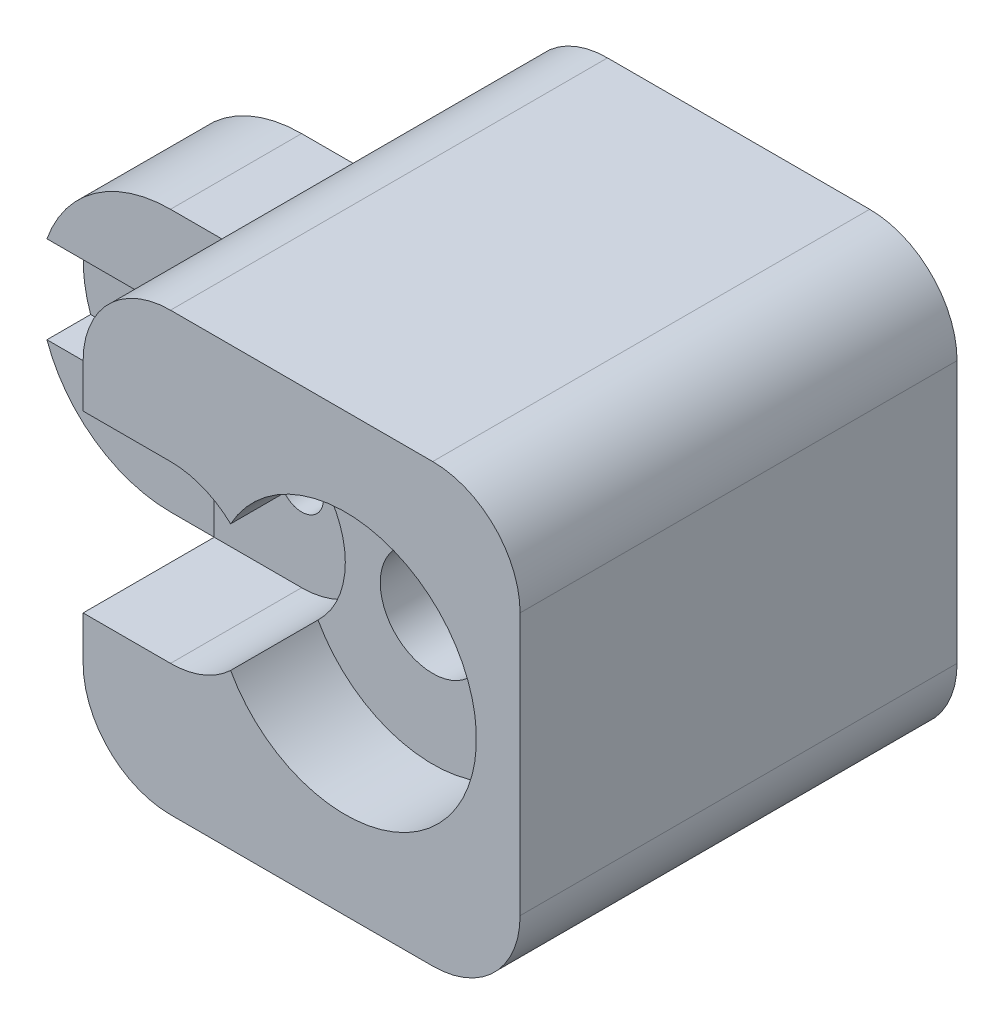
ISO-10303-21;
HEADER;
FILE_DESCRIPTION(('STEP AP214'),'2;1');
FILE_NAME('part.step','',(''),(''),'','','');
FILE_SCHEMA(('AUTOMOTIVE_DESIGN { 1 0 10303 214 1 1 1 1 }'));
ENDSEC;
DATA;
#1=APPLICATION_CONTEXT('core data for automotive mechanical design processes');
#2=APPLICATION_PROTOCOL_DEFINITION('international standard','automotive_design',2000,#1);
#3=PRODUCT_CONTEXT('',#1,'mechanical');
#4=PRODUCT('Part','Part','',(#3));
#5=PRODUCT_RELATED_PRODUCT_CATEGORY('part','',(#4));
#6=PRODUCT_DEFINITION_FORMATION('','',#4);
#7=PRODUCT_DEFINITION_CONTEXT('part definition',#1,'design');
#8=PRODUCT_DEFINITION('design','',#6,#7);
#9=PRODUCT_DEFINITION_SHAPE('','',#8);
#10=(LENGTH_UNIT() NAMED_UNIT(*) SI_UNIT(.MILLI.,.METRE.));
#11=(NAMED_UNIT(*) PLANE_ANGLE_UNIT() SI_UNIT($,.RADIAN.));
#12=(NAMED_UNIT(*) SI_UNIT($,.STERADIAN.) SOLID_ANGLE_UNIT());
#13=UNCERTAINTY_MEASURE_WITH_UNIT(LENGTH_MEASURE(1.E-05),#10,'distance_accuracy_value','');
#14=(GEOMETRIC_REPRESENTATION_CONTEXT(3) GLOBAL_UNCERTAINTY_ASSIGNED_CONTEXT((#13)) GLOBAL_UNIT_ASSIGNED_CONTEXT((#10,
#11,#12)) REPRESENTATION_CONTEXT('',''));
#15=CARTESIAN_POINT('',(0.,0.,0.));
#16=DIRECTION('',(0.,0.,1.));
#17=DIRECTION('',(1.,0.,0.));
#18=AXIS2_PLACEMENT_3D('',#15,#16,#17);
#19=CARTESIAN_POINT('',(0.,0.,100.));
#20=DIRECTION('',(1.,0.,0.));
#21=DIRECTION('',(0.,0.,-1.));
#22=AXIS2_PLACEMENT_3D('',#19,#20,#21);
#23=PLANE('',#22);
#24=DIRECTION('',(0.,0.,-1.));
#25=VECTOR('',#24,1.);
#26=CARTESIAN_POINT('',(0.,70.,20.));
#27=LINE('',#26,#25);
#28=CARTESIAN_POINT('',(0.,70.,20.));
#29=VERTEX_POINT('',#28);
#30=CARTESIAN_POINT('',(0.,70.,0.));
#31=VERTEX_POINT('',#30);
#32=EDGE_CURVE('E235',#29,#31,#27,.T.);
#33=ORIENTED_EDGE('',*,*,#32,.F.);
#34=DIRECTION('',(0.,1.,0.));
#35=VECTOR('',#34,1.);
#36=CARTESIAN_POINT('',(0.,0.,20.));
#37=LINE('',#36,#35);
#38=CARTESIAN_POINT('',(0.,30.,20.));
#39=VERTEX_POINT('',#38);
#40=EDGE_CURVE('E213',#39,#29,#37,.T.);
#41=ORIENTED_EDGE('',*,*,#40,.F.);
#42=DIRECTION('',(0.,0.,-1.));
#43=VECTOR('',#42,1.);
#44=CARTESIAN_POINT('',(0.,30.,20.));
#45=LINE('',#44,#43);
#46=CARTESIAN_POINT('',(0.,30.,0.));
#47=VERTEX_POINT('',#46);
#48=EDGE_CURVE('E238',#39,#47,#45,.T.);
#49=ORIENTED_EDGE('',*,*,#48,.T.);
#50=DIRECTION('',(0.,-1.,0.));
#51=VECTOR('',#50,1.);
#52=CARTESIAN_POINT('',(0.,0.,0.));
#53=LINE('',#52,#51);
#54=CARTESIAN_POINT('',(0.,20.,0.));
#55=VERTEX_POINT('',#54);
#56=EDGE_CURVE('E389',#47,#55,#53,.T.);
#57=ORIENTED_EDGE('',*,*,#56,.T.);
#58=DIRECTION('',(0.,0.,1.));
#59=VECTOR('',#58,1.);
#60=CARTESIAN_POINT('',(0.,20.,0.));
#61=LINE('',#60,#59);
#62=CARTESIAN_POINT('',(0.,20.,30.));
#63=VERTEX_POINT('',#62);
#64=EDGE_CURVE('E355',#55,#63,#61,.T.);
#65=ORIENTED_EDGE('',*,*,#64,.T.);
#66=DIRECTION('',(0.,1.,0.));
#67=VECTOR('',#66,1.);
#68=CARTESIAN_POINT('',(0.,80.,30.));
#69=LINE('',#68,#67);
#70=CARTESIAN_POINT('',(0.,80.,30.));
#71=VERTEX_POINT('',#70);
#72=EDGE_CURVE('E308',#63,#71,#69,.T.);
#73=ORIENTED_EDGE('',*,*,#72,.T.);
#74=DIRECTION('',(0.,0.,1.));
#75=VECTOR('',#74,1.);
#76=CARTESIAN_POINT('',(0.,80.,0.));
#77=LINE('',#76,#75);
#78=CARTESIAN_POINT('',(0.,80.,0.));
#79=VERTEX_POINT('',#78);
#80=EDGE_CURVE('E386',#79,#71,#77,.T.);
#81=ORIENTED_EDGE('',*,*,#80,.F.);
#82=EDGE_CURVE('E404',#79,#31,#53,.T.);
#83=ORIENTED_EDGE('',*,*,#82,.T.);
#84=EDGE_LOOP('',(#33,#41,#49,#57,#65,#73,#81,#83));
#85=FACE_BOUND('',#84,.T.);
#86=ADVANCED_FACE('F35',(#85),#23,.F.);
#87=CARTESIAN_POINT('',(0.,0.,0.));
#88=DIRECTION('',(0.,0.,-1.));
#89=DIRECTION('',(-1.,0.,0.));
#90=AXIS2_PLACEMENT_3D('',#87,#88,#89);
#91=PLANE('',#90);
#92=CARTESIAN_POINT('',(60.,50.,0.));
#93=DIRECTION('',(0.,0.,-1.));
#94=DIRECTION('',(-1.,0.,0.));
#95=AXIS2_PLACEMENT_3D('',#92,#93,#94);
#96=CIRCLE('',#95,12.);
#97=CARTESIAN_POINT('',(48.,50.,0.));
#98=VERTEX_POINT('',#97);
#99=EDGE_CURVE('E342',#98,#98,#96,.T.);
#100=ORIENTED_EDGE('',*,*,#99,.F.);
#101=EDGE_LOOP('',(#100));
#102=FACE_BOUND('',#101,.T.);
#103=CARTESIAN_POINT('',(20.,50.,0.));
#104=DIRECTION('',(0.,0.,-1.));
#105=DIRECTION('',(-1.,0.,0.));
#106=AXIS2_PLACEMENT_3D('',#103,#104,#105);
#107=CIRCLE('',#106,20.);
#108=CARTESIAN_POINT('',(20.,70.,0.));
#109=VERTEX_POINT('',#108);
#110=CARTESIAN_POINT('',(20.,30.,0.));
#111=VERTEX_POINT('',#110);
#112=EDGE_CURVE('E232',#109,#111,#107,.T.);
#113=ORIENTED_EDGE('',*,*,#112,.F.);
#114=DIRECTION('',(-1.,0.,0.));
#115=VECTOR('',#114,1.);
#116=CARTESIAN_POINT('',(0.,70.,0.));
#117=LINE('',#116,#115);
#118=EDGE_CURVE('E50',#109,#31,#117,.T.);
#119=ORIENTED_EDGE('',*,*,#118,.T.);
#120=ORIENTED_EDGE('',*,*,#82,.F.);
#121=CARTESIAN_POINT('',(20.,80.,0.));
#122=DIRECTION('',(0.,0.,-1.));
#123=DIRECTION('',(1.,0.,0.));
#124=AXIS2_PLACEMENT_3D('',#121,#122,#123);
#125=CIRCLE('',#124,20.);
#126=CARTESIAN_POINT('',(20.,100.,0.));
#127=VERTEX_POINT('',#126);
#128=EDGE_CURVE('E380',#79,#127,#125,.T.);
#129=ORIENTED_EDGE('',*,*,#128,.T.);
#130=DIRECTION('',(-1.,0.,0.));
#131=VECTOR('',#130,1.);
#132=CARTESIAN_POINT('',(0.,100.,0.));
#133=LINE('',#132,#131);
#134=CARTESIAN_POINT('',(80.,100.,0.));
#135=VERTEX_POINT('',#134);
#136=EDGE_CURVE('E411',#135,#127,#133,.T.);
#137=ORIENTED_EDGE('',*,*,#136,.F.);
#138=CARTESIAN_POINT('',(80.,80.,0.));
#139=DIRECTION('',(0.,0.,-1.));
#140=DIRECTION('',(-1.,0.,0.));
#141=AXIS2_PLACEMENT_3D('',#138,#139,#140);
#142=CIRCLE('',#141,20.);
#143=CARTESIAN_POINT('',(100.,80.,0.));
#144=VERTEX_POINT('',#143);
#145=EDGE_CURVE('E369',#135,#144,#142,.T.);
#146=ORIENTED_EDGE('',*,*,#145,.T.);
#147=DIRECTION('',(0.,1.,0.));
#148=VECTOR('',#147,1.);
#149=CARTESIAN_POINT('',(100.,0.,0.));
#150=LINE('',#149,#148);
#151=CARTESIAN_POINT('',(100.,20.,0.));
#152=VERTEX_POINT('',#151);
#153=EDGE_CURVE('E409',#152,#144,#150,.T.);
#154=ORIENTED_EDGE('',*,*,#153,.F.);
#155=CARTESIAN_POINT('',(80.,20.,0.));
#156=DIRECTION('',(0.,0.,-1.));
#157=DIRECTION('',(1.,0.,0.));
#158=AXIS2_PLACEMENT_3D('',#155,#156,#157);
#159=CIRCLE('',#158,20.);
#160=CARTESIAN_POINT('',(80.,0.,0.));
#161=VERTEX_POINT('',#160);
#162=EDGE_CURVE('E358',#152,#161,#159,.T.);
#163=ORIENTED_EDGE('',*,*,#162,.T.);
#164=DIRECTION('',(1.,0.,0.));
#165=VECTOR('',#164,1.);
#166=CARTESIAN_POINT('',(0.,0.,0.));
#167=LINE('',#166,#165);
#168=CARTESIAN_POINT('',(20.,0.,0.));
#169=VERTEX_POINT('',#168);
#170=EDGE_CURVE('E407',#169,#161,#167,.T.);
#171=ORIENTED_EDGE('',*,*,#170,.F.);
#172=CARTESIAN_POINT('',(20.,20.,0.));
#173=DIRECTION('',(0.,0.,-1.));
#174=DIRECTION('',(1.,0.,0.));
#175=AXIS2_PLACEMENT_3D('',#172,#173,#174);
#176=CIRCLE('',#175,20.);
#177=EDGE_CURVE('E346',#169,#55,#176,.T.);
#178=ORIENTED_EDGE('',*,*,#177,.T.);
#179=ORIENTED_EDGE('',*,*,#56,.F.);
#180=DIRECTION('',(-1.,0.,0.));
#181=VECTOR('',#180,1.);
#182=CARTESIAN_POINT('',(0.,30.,0.));
#183=LINE('',#182,#181);
#184=EDGE_CURVE('E222',#111,#47,#183,.T.);
#185=ORIENTED_EDGE('',*,*,#184,.F.);
#186=EDGE_LOOP('',(#113,#119,#120,#129,#137,#146,#154,#163,#171,#178,#179,#185));
#187=FACE_BOUND('',#186,.T.);
#188=ADVANCED_FACE('F452',(#102,#187),#91,.T.);
#189=CARTESIAN_POINT('',(20.,50.,70.));
#190=DIRECTION('',(0.,0.,-1.));
#191=DIRECTION('',(-1.,0.,0.));
#192=AXIS2_PLACEMENT_3D('',#189,#190,#191);
#193=CYLINDRICAL_SURFACE('',#192,5.);
#194=CARTESIAN_POINT('',(20.,50.,20.));
#195=DIRECTION('',(0.,0.,-1.));
#196=DIRECTION('',(-1.,0.,0.));
#197=AXIS2_PLACEMENT_3D('',#194,#195,#196);
#198=CIRCLE('',#197,5.);
#199=CARTESIAN_POINT('',(15.,50.,20.));
#200=VERTEX_POINT('',#199);
#201=EDGE_CURVE('E237',#200,#200,#198,.T.);
#202=ORIENTED_EDGE('',*,*,#201,.T.);
#203=EDGE_LOOP('',(#202));
#204=FACE_BOUND('',#203,.T.);
#205=CARTESIAN_POINT('',(20.,50.,70.));
#206=DIRECTION('',(0.,0.,-1.));
#207=DIRECTION('',(-1.,0.,0.));
#208=AXIS2_PLACEMENT_3D('',#205,#206,#207);
#209=CIRCLE('',#208,5.);
#210=CARTESIAN_POINT('',(15.,50.,70.));
#211=VERTEX_POINT('',#210);
#212=EDGE_CURVE('E270',#211,#211,#209,.T.);
#213=ORIENTED_EDGE('',*,*,#212,.F.);
#214=EDGE_LOOP('',(#213));
#215=FACE_BOUND('',#214,.T.);
#216=ADVANCED_FACE('F512',(#204,#215),#193,.F.);
#217=CARTESIAN_POINT('',(20.,50.,80.));
#218=DIRECTION('',(0.,0.,-1.));
#219=DIRECTION('',(-1.,0.,0.));
#220=AXIS2_PLACEMENT_3D('',#217,#218,#219);
#221=PLANE('',#220);
#222=CARTESIAN_POINT('',(60.,50.,80.));
#223=DIRECTION('',(0.,0.,1.));
#224=DIRECTION('',(1.,0.,0.));
#225=AXIS2_PLACEMENT_3D('',#222,#223,#224);
#226=CIRCLE('',#225,12.);
#227=CARTESIAN_POINT('',(72.,50.,80.));
#228=VERTEX_POINT('',#227);
#229=EDGE_CURVE('E248',#228,#228,#226,.F.);
#230=ORIENTED_EDGE('',*,*,#229,.T.);
#231=EDGE_LOOP('',(#230));
#232=FACE_BOUND('',#231,.T.);
#233=CARTESIAN_POINT('',(20.,50.,80.));
#234=DIRECTION('',(0.,0.,-1.));
#235=DIRECTION('',(-1.,0.,0.));
#236=AXIS2_PLACEMENT_3D('',#233,#234,#235);
#237=CIRCLE('',#236,20.);
#238=CARTESIAN_POINT('',(33.75,35.4763124517222,80.));
#239=VERTEX_POINT('',#238);
#240=CARTESIAN_POINT('',(33.75,64.5236875482778,80.));
#241=VERTEX_POINT('',#240);
#242=EDGE_CURVE('E11',#239,#241,#237,.F.);
#243=ORIENTED_EDGE('',*,*,#242,.F.);
#244=CARTESIAN_POINT('',(60.,50.,80.));
#245=DIRECTION('',(0.,0.,1.));
#246=DIRECTION('',(1.,0.,0.));
#247=AXIS2_PLACEMENT_3D('',#244,#245,#246);
#248=CIRCLE('',#247,30.);
#249=EDGE_CURVE('E246',#239,#241,#248,.T.);
#250=ORIENTED_EDGE('',*,*,#249,.T.);
#251=EDGE_LOOP('',(#243,#250));
#252=FACE_BOUND('',#251,.T.);
#253=ADVANCED_FACE('F550',(#232,#252),#221,.F.);
#254=CARTESIAN_POINT('',(20.,50.,70.));
#255=DIRECTION('',(0.,0.,1.));
#256=DIRECTION('',(1.,0.,0.));
#257=AXIS2_PLACEMENT_3D('',#254,#255,#256);
#258=CYLINDRICAL_SURFACE('',#257,20.);
#259=DIRECTION('',(0.,0.,1.));
#260=VECTOR('',#259,1.);
#261=CARTESIAN_POINT('',(33.75,35.4763124517222,85.));
#262=LINE('',#261,#260);
#263=CARTESIAN_POINT('',(33.75,35.4763124517222,100.));
#264=VERTEX_POINT('',#263);
#265=EDGE_CURVE('E403',#264,#239,#262,.F.);
#266=ORIENTED_EDGE('',*,*,#265,.T.);
#267=ORIENTED_EDGE('',*,*,#242,.T.);
#268=DIRECTION('',(0.,0.,1.));
#269=VECTOR('',#268,1.);
#270=CARTESIAN_POINT('',(33.75,64.5236875482778,85.));
#271=LINE('',#270,#269);
#272=CARTESIAN_POINT('',(33.75,64.5236875482778,100.));
#273=VERTEX_POINT('',#272);
#274=EDGE_CURVE('E43',#241,#273,#271,.T.);
#275=ORIENTED_EDGE('',*,*,#274,.T.);
#276=CARTESIAN_POINT('',(20.,50.,100.));
#277=DIRECTION('',(0.,0.,1.));
#278=DIRECTION('',(-1.,0.,0.));
#279=AXIS2_PLACEMENT_3D('',#276,#277,#278);
#280=CIRCLE('',#279,20.);
#281=CARTESIAN_POINT('',(20.,70.,100.));
#282=VERTEX_POINT('',#281);
#283=EDGE_CURVE('E251',#273,#282,#280,.T.);
#284=ORIENTED_EDGE('',*,*,#283,.T.);
#285=DIRECTION('',(0.,0.,1.));
#286=VECTOR('',#285,1.);
#287=CARTESIAN_POINT('',(20.,70.,70.));
#288=LINE('',#287,#286);
#289=CARTESIAN_POINT('',(20.,70.,70.));
#290=VERTEX_POINT('',#289);
#291=EDGE_CURVE('E261',#290,#282,#288,.T.);
#292=ORIENTED_EDGE('',*,*,#291,.F.);
#293=CARTESIAN_POINT('',(20.,50.,70.));
#294=DIRECTION('',(0.,0.,1.));
#295=DIRECTION('',(1.,0.,0.));
#296=AXIS2_PLACEMENT_3D('',#293,#294,#295);
#297=CIRCLE('',#296,20.);
#298=CARTESIAN_POINT('',(20.,30.,70.));
#299=VERTEX_POINT('',#298);
#300=EDGE_CURVE('E244',#290,#299,#297,.F.);
#301=ORIENTED_EDGE('',*,*,#300,.T.);
#302=DIRECTION('',(0.,0.,1.));
#303=VECTOR('',#302,1.);
#304=CARTESIAN_POINT('',(20.,30.,70.));
#305=LINE('',#304,#303);
#306=CARTESIAN_POINT('',(20.,30.,100.));
#307=VERTEX_POINT('',#306);
#308=EDGE_CURVE('E268',#299,#307,#305,.T.);
#309=ORIENTED_EDGE('',*,*,#308,.T.);
#310=EDGE_CURVE('E262',#307,#264,#280,.T.);
#311=ORIENTED_EDGE('',*,*,#310,.T.);
#312=EDGE_LOOP('',(#266,#267,#275,#284,#292,#301,#309,#311));
#313=FACE_BOUND('',#312,.T.);
#314=ADVANCED_FACE('F418',(#313),#258,.F.);
#315=CARTESIAN_POINT('',(20.,50.,70.));
#316=DIRECTION('',(0.,0.,-1.));
#317=DIRECTION('',(-1.,0.,0.));
#318=AXIS2_PLACEMENT_3D('',#315,#316,#317);
#319=PLANE('',#318);
#320=ORIENTED_EDGE('',*,*,#212,.T.);
#321=EDGE_LOOP('',(#320));
#322=FACE_BOUND('',#321,.T.);
#323=ORIENTED_EDGE('',*,*,#300,.F.);
#324=DIRECTION('',(-1.,0.,0.));
#325=VECTOR('',#324,1.);
#326=CARTESIAN_POINT('',(20.,70.,70.));
#327=LINE('',#326,#325);
#328=CARTESIAN_POINT('',(0.,70.,70.));
#329=VERTEX_POINT('',#328);
#330=EDGE_CURVE('E252',#290,#329,#327,.T.);
#331=ORIENTED_EDGE('',*,*,#330,.T.);
#332=DIRECTION('',(0.,-1.,0.));
#333=VECTOR('',#332,1.);
#334=CARTESIAN_POINT('',(0.,70.,70.));
#335=LINE('',#334,#333);
#336=CARTESIAN_POINT('',(0.,30.,70.));
#337=VERTEX_POINT('',#336);
#338=EDGE_CURVE('E255',#329,#337,#335,.T.);
#339=ORIENTED_EDGE('',*,*,#338,.T.);
#340=DIRECTION('',(1.,0.,0.));
#341=VECTOR('',#340,1.);
#342=CARTESIAN_POINT('',(0.,30.,70.));
#343=LINE('',#342,#341);
#344=EDGE_CURVE('E258',#337,#299,#343,.T.);
#345=ORIENTED_EDGE('',*,*,#344,.T.);
#346=EDGE_LOOP('',(#323,#331,#339,#345));
#347=FACE_BOUND('',#346,.T.);
#348=ADVANCED_FACE('F562',(#322,#347),#319,.F.);
#349=CARTESIAN_POINT('',(0.,0.,100.));
#350=DIRECTION('',(0.,0.,-1.));
#351=DIRECTION('',(-1.,0.,0.));
#352=AXIS2_PLACEMENT_3D('',#349,#350,#351);
#353=PLANE('',#352);
#354=CARTESIAN_POINT('',(60.,50.,100.));
#355=DIRECTION('',(0.,0.,-1.));
#356=DIRECTION('',(-1.,0.,0.));
#357=AXIS2_PLACEMENT_3D('',#354,#355,#356);
#358=CIRCLE('',#357,30.);
#359=EDGE_CURVE('E279',#264,#273,#358,.F.);
#360=ORIENTED_EDGE('',*,*,#359,.F.);
#361=ORIENTED_EDGE('',*,*,#310,.F.);
#362=DIRECTION('',(1.,0.,0.));
#363=VECTOR('',#362,1.);
#364=CARTESIAN_POINT('',(0.,30.,100.));
#365=LINE('',#364,#363);
#366=CARTESIAN_POINT('',(0.,30.,100.));
#367=VERTEX_POINT('',#366);
#368=EDGE_CURVE('E256',#367,#307,#365,.T.);
#369=ORIENTED_EDGE('',*,*,#368,.F.);
#370=DIRECTION('',(0.,-1.,0.));
#371=VECTOR('',#370,1.);
#372=CARTESIAN_POINT('',(0.,0.,100.));
#373=LINE('',#372,#371);
#374=CARTESIAN_POINT('',(0.,20.,100.));
#375=VERTEX_POINT('',#374);
#376=EDGE_CURVE('E397',#367,#375,#373,.T.);
#377=ORIENTED_EDGE('',*,*,#376,.T.);
#378=CARTESIAN_POINT('',(20.,20.,100.));
#379=DIRECTION('',(0.,0.,-1.));
#380=DIRECTION('',(1.,0.,0.));
#381=AXIS2_PLACEMENT_3D('',#378,#379,#380);
#382=CIRCLE('',#381,20.);
#383=CARTESIAN_POINT('',(20.,0.,100.));
#384=VERTEX_POINT('',#383);
#385=EDGE_CURVE('E345',#384,#375,#382,.T.);
#386=ORIENTED_EDGE('',*,*,#385,.F.);
#387=DIRECTION('',(1.,0.,0.));
#388=VECTOR('',#387,1.);
#389=CARTESIAN_POINT('',(0.,0.,100.));
#390=LINE('',#389,#388);
#391=CARTESIAN_POINT('',(80.,0.,100.));
#392=VERTEX_POINT('',#391);
#393=EDGE_CURVE('E396',#384,#392,#390,.T.);
#394=ORIENTED_EDGE('',*,*,#393,.T.);
#395=CARTESIAN_POINT('',(80.,20.,100.));
#396=DIRECTION('',(0.,0.,-1.));
#397=DIRECTION('',(1.,0.,0.));
#398=AXIS2_PLACEMENT_3D('',#395,#396,#397);
#399=CIRCLE('',#398,20.);
#400=CARTESIAN_POINT('',(100.,20.,100.));
#401=VERTEX_POINT('',#400);
#402=EDGE_CURVE('E354',#401,#392,#399,.T.);
#403=ORIENTED_EDGE('',*,*,#402,.F.);
#404=DIRECTION('',(0.,1.,0.));
#405=VECTOR('',#404,1.);
#406=CARTESIAN_POINT('',(100.,0.,100.));
#407=LINE('',#406,#405);
#408=CARTESIAN_POINT('',(100.,80.,100.));
#409=VERTEX_POINT('',#408);
#410=EDGE_CURVE('E399',#401,#409,#407,.T.);
#411=ORIENTED_EDGE('',*,*,#410,.T.);
#412=CARTESIAN_POINT('',(80.,80.,100.));
#413=DIRECTION('',(0.,0.,-1.));
#414=DIRECTION('',(-1.,0.,0.));
#415=AXIS2_PLACEMENT_3D('',#412,#413,#414);
#416=CIRCLE('',#415,20.);
#417=CARTESIAN_POINT('',(80.,100.,100.));
#418=VERTEX_POINT('',#417);
#419=EDGE_CURVE('E366',#418,#409,#416,.T.);
#420=ORIENTED_EDGE('',*,*,#419,.F.);
#421=DIRECTION('',(-1.,0.,0.));
#422=VECTOR('',#421,1.);
#423=CARTESIAN_POINT('',(0.,100.,100.));
#424=LINE('',#423,#422);
#425=CARTESIAN_POINT('',(20.,100.,100.));
#426=VERTEX_POINT('',#425);
#427=EDGE_CURVE('E401',#418,#426,#424,.T.);
#428=ORIENTED_EDGE('',*,*,#427,.T.);
#429=CARTESIAN_POINT('',(20.,80.,100.));
#430=DIRECTION('',(0.,0.,-1.));
#431=DIRECTION('',(1.,0.,0.));
#432=AXIS2_PLACEMENT_3D('',#429,#430,#431);
#433=CIRCLE('',#432,20.);
#434=CARTESIAN_POINT('',(0.,80.,100.));
#435=VERTEX_POINT('',#434);
#436=EDGE_CURVE('E377',#435,#426,#433,.T.);
#437=ORIENTED_EDGE('',*,*,#436,.F.);
#438=CARTESIAN_POINT('',(0.,70.,100.));
#439=VERTEX_POINT('',#438);
#440=EDGE_CURVE('E393',#435,#439,#373,.T.);
#441=ORIENTED_EDGE('',*,*,#440,.T.);
#442=DIRECTION('',(-1.,0.,0.));
#443=VECTOR('',#442,1.);
#444=CARTESIAN_POINT('',(20.,70.,100.));
#445=LINE('',#444,#443);
#446=EDGE_CURVE('E264',#282,#439,#445,.T.);
#447=ORIENTED_EDGE('',*,*,#446,.F.);
#448=ORIENTED_EDGE('',*,*,#283,.F.);
#449=EDGE_LOOP('',(#360,#361,#369,#377,#386,#394,#403,#411,#420,#428,#437,#441,#447,#448));
#450=FACE_BOUND('',#449,.T.);
#451=ADVANCED_FACE('F424',(#450),#353,.F.);
#452=CARTESIAN_POINT('',(60.,50.,80.));
#453=DIRECTION('',(0.,0.,-1.));
#454=DIRECTION('',(-1.,0.,0.));
#455=AXIS2_PLACEMENT_3D('',#452,#453,#454);
#456=CYLINDRICAL_SURFACE('',#455,12.);
#457=ORIENTED_EDGE('',*,*,#99,.T.);
#458=EDGE_LOOP('',(#457));
#459=FACE_BOUND('',#458,.T.);
#460=ORIENTED_EDGE('',*,*,#229,.F.);
#461=EDGE_LOOP('',(#460));
#462=FACE_BOUND('',#461,.T.);
#463=ADVANCED_FACE('F521',(#459,#462),#456,.F.);
#464=CARTESIAN_POINT('',(-20.,50.,30.));
#465=DIRECTION('',(0.,0.,1.));
#466=DIRECTION('',(1.,0.,0.));
#467=AXIS2_PLACEMENT_3D('',#464,#465,#466);
#468=CYLINDRICAL_SURFACE('',#467,10.);
#469=CARTESIAN_POINT('',(-20.,50.,30.));
#470=DIRECTION('',(0.,0.,1.));
#471=DIRECTION('',(1.,0.,0.));
#472=AXIS2_PLACEMENT_3D('',#469,#470,#471);
#473=CIRCLE('',#472,10.);
#474=CARTESIAN_POINT('',(-10.,50.,30.));
#475=VERTEX_POINT('',#474);
#476=EDGE_CURVE('E305',#475,#475,#473,.T.);
#477=ORIENTED_EDGE('',*,*,#476,.F.);
#478=EDGE_LOOP('',(#477));
#479=FACE_BOUND('',#478,.T.);
#480=DIRECTION('',(0.,0.,1.));
#481=VECTOR('',#480,1.);
#482=CARTESIAN_POINT('',(-20.,40.,50.));
#483=LINE('',#482,#481);
#484=CARTESIAN_POINT('',(-20.,40.,50.));
#485=VERTEX_POINT('',#484);
#486=CARTESIAN_POINT('',(-20.,40.,60.));
#487=VERTEX_POINT('',#486);
#488=EDGE_CURVE('E295',#485,#487,#483,.T.);
#489=ORIENTED_EDGE('',*,*,#488,.T.);
#490=CARTESIAN_POINT('',(-20.,50.,60.));
#491=DIRECTION('',(0.,0.,1.));
#492=DIRECTION('',(1.,0.,0.));
#493=AXIS2_PLACEMENT_3D('',#490,#491,#492);
#494=CIRCLE('',#493,10.);
#495=CARTESIAN_POINT('',(-20.,60.,60.));
#496=VERTEX_POINT('',#495);
#497=EDGE_CURVE('E298',#487,#496,#494,.T.);
#498=ORIENTED_EDGE('',*,*,#497,.T.);
#499=DIRECTION('',(0.,0.,1.));
#500=VECTOR('',#499,1.);
#501=CARTESIAN_POINT('',(-20.,60.,50.));
#502=LINE('',#501,#500);
#503=CARTESIAN_POINT('',(-20.,60.,50.));
#504=VERTEX_POINT('',#503);
#505=EDGE_CURVE('E291',#504,#496,#502,.T.);
#506=ORIENTED_EDGE('',*,*,#505,.F.);
#507=CARTESIAN_POINT('',(-20.,50.,50.));
#508=DIRECTION('',(0.,0.,-1.));
#509=DIRECTION('',(1.,0.,0.));
#510=AXIS2_PLACEMENT_3D('',#507,#508,#509);
#511=CIRCLE('',#510,10.);
#512=EDGE_CURVE('E280',#485,#504,#511,.T.);
#513=ORIENTED_EDGE('',*,*,#512,.F.);
#514=EDGE_LOOP('',(#489,#498,#506,#513));
#515=FACE_BOUND('',#514,.T.);
#516=ADVANCED_FACE('F516',(#479,#515),#468,.F.);
#517=ORIENTED_EDGE('',*,*,#376,.F.);
#518=DIRECTION('',(0.,0.,1.));
#519=VECTOR('',#518,1.);
#520=CARTESIAN_POINT('',(0.,30.,70.));
#521=LINE('',#520,#519);
#522=EDGE_CURVE('E271',#337,#367,#521,.T.);
#523=ORIENTED_EDGE('',*,*,#522,.F.);
#524=ORIENTED_EDGE('',*,*,#338,.F.);
#525=DIRECTION('',(0.,0.,1.));
#526=VECTOR('',#525,1.);
#527=CARTESIAN_POINT('',(0.,70.,70.));
#528=LINE('',#527,#526);
#529=EDGE_CURVE('E273',#329,#439,#528,.T.);
#530=ORIENTED_EDGE('',*,*,#529,.T.);
#531=ORIENTED_EDGE('',*,*,#440,.F.);
#532=CARTESIAN_POINT('',(0.,80.,60.));
#533=VERTEX_POINT('',#532);
#534=EDGE_CURVE('E390',#533,#435,#77,.T.);
#535=ORIENTED_EDGE('',*,*,#534,.F.);
#536=DIRECTION('',(0.,1.,0.));
#537=VECTOR('',#536,1.);
#538=CARTESIAN_POINT('',(0.,80.,60.));
#539=LINE('',#538,#537);
#540=CARTESIAN_POINT('',(0.,20.,60.));
#541=VERTEX_POINT('',#540);
#542=EDGE_CURVE('E311',#541,#533,#539,.T.);
#543=ORIENTED_EDGE('',*,*,#542,.F.);
#544=EDGE_CURVE('E349',#541,#375,#61,.T.);
#545=ORIENTED_EDGE('',*,*,#544,.T.);
#546=EDGE_LOOP('',(#517,#523,#524,#530,#531,#535,#543,#545));
#547=FACE_BOUND('',#546,.T.);
#548=ADVANCED_FACE('F37',(#547),#23,.F.);
#549=CARTESIAN_POINT('',(0.,0.,100.));
#550=DIRECTION('',(0.,1.,0.));
#551=DIRECTION('',(0.,0.,1.));
#552=AXIS2_PLACEMENT_3D('',#549,#550,#551);
#553=PLANE('',#552);
#554=ORIENTED_EDGE('',*,*,#393,.F.);
#555=DIRECTION('',(0.,0.,1.));
#556=VECTOR('',#555,1.);
#557=CARTESIAN_POINT('',(20.,0.,0.));
#558=LINE('',#557,#556);
#559=EDGE_CURVE('E352',#169,#384,#558,.T.);
#560=ORIENTED_EDGE('',*,*,#559,.F.);
#561=ORIENTED_EDGE('',*,*,#170,.T.);
#562=DIRECTION('',(0.,0.,1.));
#563=VECTOR('',#562,1.);
#564=CARTESIAN_POINT('',(80.,0.,0.));
#565=LINE('',#564,#563);
#566=EDGE_CURVE('E361',#161,#392,#565,.T.);
#567=ORIENTED_EDGE('',*,*,#566,.T.);
#568=EDGE_LOOP('',(#554,#560,#561,#567));
#569=FACE_BOUND('',#568,.T.);
#570=ADVANCED_FACE('F444',(#569),#553,.F.);
#571=CARTESIAN_POINT('',(100.,0.,100.));
#572=DIRECTION('',(-1.,0.,0.));
#573=DIRECTION('',(0.,0.,1.));
#574=AXIS2_PLACEMENT_3D('',#571,#572,#573);
#575=PLANE('',#574);
#576=ORIENTED_EDGE('',*,*,#410,.F.);
#577=DIRECTION('',(0.,0.,1.));
#578=VECTOR('',#577,1.);
#579=CARTESIAN_POINT('',(100.,20.,0.));
#580=LINE('',#579,#578);
#581=EDGE_CURVE('E364',#152,#401,#580,.T.);
#582=ORIENTED_EDGE('',*,*,#581,.F.);
#583=ORIENTED_EDGE('',*,*,#153,.T.);
#584=DIRECTION('',(0.,0.,1.));
#585=VECTOR('',#584,1.);
#586=CARTESIAN_POINT('',(100.,80.,0.));
#587=LINE('',#586,#585);
#588=EDGE_CURVE('E372',#144,#409,#587,.T.);
#589=ORIENTED_EDGE('',*,*,#588,.T.);
#590=EDGE_LOOP('',(#576,#582,#583,#589));
#591=FACE_BOUND('',#590,.T.);
#592=ADVANCED_FACE('F457',(#591),#575,.F.);
#593=CARTESIAN_POINT('',(0.,100.,100.));
#594=DIRECTION('',(0.,-1.,0.));
#595=DIRECTION('',(0.,0.,-1.));
#596=AXIS2_PLACEMENT_3D('',#593,#594,#595);
#597=PLANE('',#596);
#598=ORIENTED_EDGE('',*,*,#427,.F.);
#599=DIRECTION('',(0.,0.,1.));
#600=VECTOR('',#599,1.);
#601=CARTESIAN_POINT('',(80.,100.,0.));
#602=LINE('',#601,#600);
#603=EDGE_CURVE('E375',#135,#418,#602,.T.);
#604=ORIENTED_EDGE('',*,*,#603,.F.);
#605=ORIENTED_EDGE('',*,*,#136,.T.);
#606=DIRECTION('',(0.,0.,1.));
#607=VECTOR('',#606,1.);
#608=CARTESIAN_POINT('',(20.,100.,0.));
#609=LINE('',#608,#607);
#610=EDGE_CURVE('E383',#127,#426,#609,.T.);
#611=ORIENTED_EDGE('',*,*,#610,.T.);
#612=EDGE_LOOP('',(#598,#604,#605,#611));
#613=FACE_BOUND('',#612,.T.);
#614=ADVANCED_FACE('F465',(#613),#597,.F.);
#615=CARTESIAN_POINT('',(20.,80.,0.));
#616=DIRECTION('',(0.,0.,1.));
#617=DIRECTION('',(1.,0.,0.));
#618=AXIS2_PLACEMENT_3D('',#615,#616,#617);
#619=CYLINDRICAL_SURFACE('',#618,20.);
#620=ORIENTED_EDGE('',*,*,#436,.T.);
#621=ORIENTED_EDGE('',*,*,#610,.F.);
#622=ORIENTED_EDGE('',*,*,#128,.F.);
#623=ORIENTED_EDGE('',*,*,#80,.T.);
#624=DIRECTION('',(0.,0.,-1.));
#625=VECTOR('',#624,1.);
#626=CARTESIAN_POINT('',(0.,80.,60.));
#627=LINE('',#626,#625);
#628=EDGE_CURVE('E339',#533,#71,#627,.T.);
#629=ORIENTED_EDGE('',*,*,#628,.F.);
#630=ORIENTED_EDGE('',*,*,#534,.T.);
#631=EDGE_LOOP('',(#620,#621,#622,#623,#629,#630));
#632=FACE_BOUND('',#631,.T.);
#633=ADVANCED_FACE('F468',(#632),#619,.T.);
#634=CARTESIAN_POINT('',(80.,80.,0.));
#635=DIRECTION('',(0.,0.,1.));
#636=DIRECTION('',(1.,0.,0.));
#637=AXIS2_PLACEMENT_3D('',#634,#635,#636);
#638=CYLINDRICAL_SURFACE('',#637,20.);
#639=ORIENTED_EDGE('',*,*,#419,.T.);
#640=ORIENTED_EDGE('',*,*,#588,.F.);
#641=ORIENTED_EDGE('',*,*,#145,.F.);
#642=ORIENTED_EDGE('',*,*,#603,.T.);
#643=EDGE_LOOP('',(#639,#640,#641,#642));
#644=FACE_BOUND('',#643,.T.);
#645=ADVANCED_FACE('F459',(#644),#638,.T.);
#646=CARTESIAN_POINT('',(80.,20.,0.));
#647=DIRECTION('',(0.,0.,1.));
#648=DIRECTION('',(1.,0.,0.));
#649=AXIS2_PLACEMENT_3D('',#646,#647,#648);
#650=CYLINDRICAL_SURFACE('',#649,20.);
#651=ORIENTED_EDGE('',*,*,#402,.T.);
#652=ORIENTED_EDGE('',*,*,#566,.F.);
#653=ORIENTED_EDGE('',*,*,#162,.F.);
#654=ORIENTED_EDGE('',*,*,#581,.T.);
#655=EDGE_LOOP('',(#651,#652,#653,#654));
#656=FACE_BOUND('',#655,.T.);
#657=ADVANCED_FACE('F448',(#656),#650,.T.);
#658=CARTESIAN_POINT('',(20.,20.,0.));
#659=DIRECTION('',(0.,0.,1.));
#660=DIRECTION('',(1.,0.,0.));
#661=AXIS2_PLACEMENT_3D('',#658,#659,#660);
#662=CYLINDRICAL_SURFACE('',#661,20.);
#663=ORIENTED_EDGE('',*,*,#385,.T.);
#664=ORIENTED_EDGE('',*,*,#544,.F.);
#665=DIRECTION('',(0.,0.,-1.));
#666=VECTOR('',#665,1.);
#667=CARTESIAN_POINT('',(0.,20.,60.));
#668=LINE('',#667,#666);
#669=EDGE_CURVE('E324',#541,#63,#668,.T.);
#670=ORIENTED_EDGE('',*,*,#669,.T.);
#671=ORIENTED_EDGE('',*,*,#64,.F.);
#672=ORIENTED_EDGE('',*,*,#177,.F.);
#673=ORIENTED_EDGE('',*,*,#559,.T.);
#674=EDGE_LOOP('',(#663,#664,#670,#671,#672,#673));
#675=FACE_BOUND('',#674,.T.);
#676=ADVANCED_FACE('F439',(#675),#662,.T.);
#677=CARTESIAN_POINT('',(0.,80.,60.));
#678=DIRECTION('',(0.,-1.,0.));
#679=DIRECTION('',(0.,0.,-1.));
#680=AXIS2_PLACEMENT_3D('',#677,#678,#679);
#681=PLANE('',#680);
#682=DIRECTION('',(-1.,0.,0.));
#683=VECTOR('',#682,1.);
#684=CARTESIAN_POINT('',(0.,80.,30.));
#685=LINE('',#684,#683);
#686=CARTESIAN_POINT('',(-20.,80.,30.));
#687=VERTEX_POINT('',#686);
#688=EDGE_CURVE('E326',#71,#687,#685,.T.);
#689=ORIENTED_EDGE('',*,*,#688,.T.);
#690=DIRECTION('',(0.,0.,-1.));
#691=VECTOR('',#690,1.);
#692=CARTESIAN_POINT('',(-20.,80.,60.));
#693=LINE('',#692,#691);
#694=CARTESIAN_POINT('',(-20.,80.,60.));
#695=VERTEX_POINT('',#694);
#696=EDGE_CURVE('E336',#695,#687,#693,.T.);
#697=ORIENTED_EDGE('',*,*,#696,.F.);
#698=DIRECTION('',(-1.,0.,0.));
#699=VECTOR('',#698,1.);
#700=CARTESIAN_POINT('',(0.,80.,60.));
#701=LINE('',#700,#699);
#702=EDGE_CURVE('E314',#533,#695,#701,.T.);
#703=ORIENTED_EDGE('',*,*,#702,.F.);
#704=ORIENTED_EDGE('',*,*,#628,.T.);
#705=EDGE_LOOP('',(#689,#697,#703,#704));
#706=FACE_BOUND('',#705,.T.);
#707=ADVANCED_FACE('F482',(#706),#681,.F.);
#708=CARTESIAN_POINT('',(-20.,50.,60.));
#709=DIRECTION('',(0.,0.,-1.));
#710=DIRECTION('',(-1.,0.,0.));
#711=AXIS2_PLACEMENT_3D('',#708,#709,#710);
#712=CYLINDRICAL_SURFACE('',#711,30.);
#713=CARTESIAN_POINT('',(-20.,50.,60.));
#714=DIRECTION('',(0.,0.,1.));
#715=DIRECTION('',(1.,0.,0.));
#716=AXIS2_PLACEMENT_3D('',#713,#714,#715);
#717=CIRCLE('',#716,30.);
#718=CARTESIAN_POINT('',(-48.2842712474619,40.,60.));
#719=VERTEX_POINT('',#718);
#720=CARTESIAN_POINT('',(-20.,20.,60.));
#721=VERTEX_POINT('',#720);
#722=EDGE_CURVE('E317',#719,#721,#717,.T.);
#723=ORIENTED_EDGE('',*,*,#722,.F.);
#724=DIRECTION('',(0.,0.,1.));
#725=VECTOR('',#724,1.);
#726=CARTESIAN_POINT('',(-48.2842712474619,40.,50.));
#727=LINE('',#726,#725);
#728=CARTESIAN_POINT('',(-48.2842712474619,40.,50.));
#729=VERTEX_POINT('',#728);
#730=EDGE_CURVE('E299',#729,#719,#727,.T.);
#731=ORIENTED_EDGE('',*,*,#730,.F.);
#732=CARTESIAN_POINT('',(-20.,50.,50.));
#733=DIRECTION('',(0.,0.,1.));
#734=DIRECTION('',(1.,0.,0.));
#735=AXIS2_PLACEMENT_3D('',#732,#733,#734);
#736=CIRCLE('',#735,30.);
#737=CARTESIAN_POINT('',(-48.2842712474619,60.,50.));
#738=VERTEX_POINT('',#737);
#739=EDGE_CURVE('E287',#738,#729,#736,.T.);
#740=ORIENTED_EDGE('',*,*,#739,.F.);
#741=DIRECTION('',(0.,0.,1.));
#742=VECTOR('',#741,1.);
#743=CARTESIAN_POINT('',(-48.2842712474619,60.,50.));
#744=LINE('',#743,#742);
#745=CARTESIAN_POINT('',(-48.2842712474619,60.,60.));
#746=VERTEX_POINT('',#745);
#747=EDGE_CURVE('E301',#738,#746,#744,.T.);
#748=ORIENTED_EDGE('',*,*,#747,.T.);
#749=EDGE_CURVE('E318',#695,#746,#717,.T.);
#750=ORIENTED_EDGE('',*,*,#749,.F.);
#751=ORIENTED_EDGE('',*,*,#696,.T.);
#752=CARTESIAN_POINT('',(-20.,50.,30.));
#753=DIRECTION('',(0.,0.,1.));
#754=DIRECTION('',(1.,0.,0.));
#755=AXIS2_PLACEMENT_3D('',#752,#753,#754);
#756=CIRCLE('',#755,30.);
#757=CARTESIAN_POINT('',(-20.,20.,30.));
#758=VERTEX_POINT('',#757);
#759=EDGE_CURVE('E328',#687,#758,#756,.T.);
#760=ORIENTED_EDGE('',*,*,#759,.T.);
#761=DIRECTION('',(0.,0.,-1.));
#762=VECTOR('',#761,1.);
#763=CARTESIAN_POINT('',(-20.,20.,60.));
#764=LINE('',#763,#762);
#765=EDGE_CURVE('E333',#721,#758,#764,.T.);
#766=ORIENTED_EDGE('',*,*,#765,.F.);
#767=EDGE_LOOP('',(#723,#731,#740,#748,#750,#751,#760,#766));
#768=FACE_BOUND('',#767,.T.);
#769=ADVANCED_FACE('F543',(#768),#712,.T.);
#770=CARTESIAN_POINT('',(0.,20.,60.));
#771=DIRECTION('',(0.,1.,0.));
#772=DIRECTION('',(-1.,0.,0.));
#773=AXIS2_PLACEMENT_3D('',#770,#771,#772);
#774=PLANE('',#773);
#775=DIRECTION('',(1.,0.,0.));
#776=VECTOR('',#775,1.);
#777=CARTESIAN_POINT('',(0.,20.,30.));
#778=LINE('',#777,#776);
#779=EDGE_CURVE('E315',#758,#63,#778,.T.);
#780=ORIENTED_EDGE('',*,*,#779,.T.);
#781=ORIENTED_EDGE('',*,*,#669,.F.);
#782=DIRECTION('',(1.,0.,0.));
#783=VECTOR('',#782,1.);
#784=CARTESIAN_POINT('',(0.,20.,60.));
#785=LINE('',#784,#783);
#786=EDGE_CURVE('E321',#721,#541,#785,.T.);
#787=ORIENTED_EDGE('',*,*,#786,.F.);
#788=ORIENTED_EDGE('',*,*,#765,.T.);
#789=EDGE_LOOP('',(#780,#781,#787,#788));
#790=FACE_BOUND('',#789,.T.);
#791=ADVANCED_FACE('F492',(#790),#774,.F.);
#792=CARTESIAN_POINT('',(-20.,50.,60.));
#793=DIRECTION('',(0.,0.,1.));
#794=DIRECTION('',(1.,0.,0.));
#795=AXIS2_PLACEMENT_3D('',#792,#793,#794);
#796=PLANE('',#795);
#797=DIRECTION('',(1.,0.,0.));
#798=VECTOR('',#797,1.);
#799=CARTESIAN_POINT('',(-20.,40.,60.));
#800=LINE('',#799,#798);
#801=EDGE_CURVE('E284',#719,#487,#800,.T.);
#802=ORIENTED_EDGE('',*,*,#801,.F.);
#803=ORIENTED_EDGE('',*,*,#722,.T.);
#804=ORIENTED_EDGE('',*,*,#786,.T.);
#805=ORIENTED_EDGE('',*,*,#542,.T.);
#806=ORIENTED_EDGE('',*,*,#702,.T.);
#807=ORIENTED_EDGE('',*,*,#749,.T.);
#808=DIRECTION('',(-1.,0.,0.));
#809=VECTOR('',#808,1.);
#810=CARTESIAN_POINT('',(-20.,60.,60.));
#811=LINE('',#810,#809);
#812=EDGE_CURVE('E292',#496,#746,#811,.T.);
#813=ORIENTED_EDGE('',*,*,#812,.F.);
#814=ORIENTED_EDGE('',*,*,#497,.F.);
#815=EDGE_LOOP('',(#802,#803,#804,#805,#806,#807,#813,#814));
#816=FACE_BOUND('',#815,.T.);
#817=ADVANCED_FACE('F486',(#816),#796,.T.);
#818=CARTESIAN_POINT('',(-20.,50.,30.));
#819=DIRECTION('',(0.,0.,1.));
#820=DIRECTION('',(1.,0.,0.));
#821=AXIS2_PLACEMENT_3D('',#818,#819,#820);
#822=PLANE('',#821);
#823=ORIENTED_EDGE('',*,*,#476,.T.);
#824=EDGE_LOOP('',(#823));
#825=FACE_BOUND('',#824,.T.);
#826=ORIENTED_EDGE('',*,*,#72,.F.);
#827=ORIENTED_EDGE('',*,*,#779,.F.);
#828=ORIENTED_EDGE('',*,*,#759,.F.);
#829=ORIENTED_EDGE('',*,*,#688,.F.);
#830=EDGE_LOOP('',(#826,#827,#828,#829));
#831=FACE_BOUND('',#830,.T.);
#832=ADVANCED_FACE('F478',(#825,#831),#822,.F.);
#833=CARTESIAN_POINT('',(-20.,40.,50.));
#834=DIRECTION('',(0.,-1.,0.));
#835=DIRECTION('',(0.,0.,-1.));
#836=AXIS2_PLACEMENT_3D('',#833,#834,#835);
#837=PLANE('',#836);
#838=ORIENTED_EDGE('',*,*,#801,.T.);
#839=ORIENTED_EDGE('',*,*,#488,.F.);
#840=DIRECTION('',(1.,0.,0.));
#841=VECTOR('',#840,1.);
#842=CARTESIAN_POINT('',(-20.,40.,50.));
#843=LINE('',#842,#841);
#844=EDGE_CURVE('E289',#729,#485,#843,.T.);
#845=ORIENTED_EDGE('',*,*,#844,.F.);
#846=ORIENTED_EDGE('',*,*,#730,.T.);
#847=EDGE_LOOP('',(#838,#839,#845,#846));
#848=FACE_BOUND('',#847,.T.);
#849=ADVANCED_FACE('F539',(#848),#837,.F.);
#850=CARTESIAN_POINT('',(-20.,60.,50.));
#851=DIRECTION('',(0.,1.,0.));
#852=DIRECTION('',(0.,0.,1.));
#853=AXIS2_PLACEMENT_3D('',#850,#851,#852);
#854=PLANE('',#853);
#855=ORIENTED_EDGE('',*,*,#812,.T.);
#856=ORIENTED_EDGE('',*,*,#747,.F.);
#857=DIRECTION('',(-1.,0.,0.));
#858=VECTOR('',#857,1.);
#859=CARTESIAN_POINT('',(-20.,60.,50.));
#860=LINE('',#859,#858);
#861=EDGE_CURVE('E283',#504,#738,#860,.T.);
#862=ORIENTED_EDGE('',*,*,#861,.F.);
#863=ORIENTED_EDGE('',*,*,#505,.T.);
#864=EDGE_LOOP('',(#855,#856,#862,#863));
#865=FACE_BOUND('',#864,.T.);
#866=ADVANCED_FACE('F533',(#865),#854,.F.);
#867=CARTESIAN_POINT('',(-20.,50.,50.));
#868=DIRECTION('',(0.,0.,1.));
#869=DIRECTION('',(1.,0.,0.));
#870=AXIS2_PLACEMENT_3D('',#867,#868,#869);
#871=PLANE('',#870);
#872=ORIENTED_EDGE('',*,*,#512,.T.);
#873=ORIENTED_EDGE('',*,*,#861,.T.);
#874=ORIENTED_EDGE('',*,*,#739,.T.);
#875=ORIENTED_EDGE('',*,*,#844,.T.);
#876=EDGE_LOOP('',(#872,#873,#874,#875));
#877=FACE_BOUND('',#876,.T.);
#878=ADVANCED_FACE('F623',(#877),#871,.T.);
#879=CARTESIAN_POINT('',(60.,50.,126.));
#880=DIRECTION('',(0.,0.,-1.));
#881=DIRECTION('',(-1.,0.,0.));
#882=AXIS2_PLACEMENT_3D('',#879,#880,#881);
#883=CYLINDRICAL_SURFACE('',#882,30.);
#884=ORIENTED_EDGE('',*,*,#249,.F.);
#885=ORIENTED_EDGE('',*,*,#265,.F.);
#886=ORIENTED_EDGE('',*,*,#359,.T.);
#887=ORIENTED_EDGE('',*,*,#274,.F.);
#888=EDGE_LOOP('',(#884,#885,#886,#887));
#889=FACE_BOUND('',#888,.T.);
#890=ADVANCED_FACE('F427',(#889),#883,.F.);
#891=CARTESIAN_POINT('',(0.,30.,70.));
#892=DIRECTION('',(0.,-1.,0.));
#893=DIRECTION('',(1.,0.,0.));
#894=AXIS2_PLACEMENT_3D('',#891,#892,#893);
#895=PLANE('',#894);
#896=ORIENTED_EDGE('',*,*,#368,.T.);
#897=ORIENTED_EDGE('',*,*,#308,.F.);
#898=ORIENTED_EDGE('',*,*,#344,.F.);
#899=ORIENTED_EDGE('',*,*,#522,.T.);
#900=EDGE_LOOP('',(#896,#897,#898,#899));
#901=FACE_BOUND('',#900,.T.);
#902=ADVANCED_FACE('F638',(#901),#895,.F.);
#903=CARTESIAN_POINT('',(20.,70.,70.));
#904=DIRECTION('',(0.,1.,0.));
#905=DIRECTION('',(0.,0.,1.));
#906=AXIS2_PLACEMENT_3D('',#903,#904,#905);
#907=PLANE('',#906);
#908=ORIENTED_EDGE('',*,*,#446,.T.);
#909=ORIENTED_EDGE('',*,*,#529,.F.);
#910=ORIENTED_EDGE('',*,*,#330,.F.);
#911=ORIENTED_EDGE('',*,*,#291,.T.);
#912=EDGE_LOOP('',(#908,#909,#910,#911));
#913=FACE_BOUND('',#912,.T.);
#914=ADVANCED_FACE('F505',(#913),#907,.F.);
#915=CARTESIAN_POINT('',(0.,70.,20.));
#916=DIRECTION('',(0.,-1.,0.));
#917=DIRECTION('',(0.,0.,-1.));
#918=AXIS2_PLACEMENT_3D('',#915,#916,#917);
#919=PLANE('',#918);
#920=ORIENTED_EDGE('',*,*,#118,.F.);
#921=DIRECTION('',(0.,0.,-1.));
#922=VECTOR('',#921,1.);
#923=CARTESIAN_POINT('',(20.,70.,20.));
#924=LINE('',#923,#922);
#925=CARTESIAN_POINT('',(20.,70.,20.));
#926=VERTEX_POINT('',#925);
#927=EDGE_CURVE('E203',#926,#109,#924,.T.);
#928=ORIENTED_EDGE('',*,*,#927,.F.);
#929=DIRECTION('',(-1.,0.,0.));
#930=VECTOR('',#929,1.);
#931=CARTESIAN_POINT('',(0.,70.,20.));
#932=LINE('',#931,#930);
#933=EDGE_CURVE('E206',#926,#29,#932,.T.);
#934=ORIENTED_EDGE('',*,*,#933,.T.);
#935=ORIENTED_EDGE('',*,*,#32,.T.);
#936=EDGE_LOOP('',(#920,#928,#934,#935));
#937=FACE_BOUND('',#936,.T.);
#938=ADVANCED_FACE('F205',(#937),#919,.T.);
#939=CARTESIAN_POINT('',(0.,30.,20.));
#940=DIRECTION('',(0.,-1.,0.));
#941=DIRECTION('',(1.,0.,0.));
#942=AXIS2_PLACEMENT_3D('',#939,#940,#941);
#943=PLANE('',#942);
#944=ORIENTED_EDGE('',*,*,#184,.T.);
#945=ORIENTED_EDGE('',*,*,#48,.F.);
#946=DIRECTION('',(-1.,0.,0.));
#947=VECTOR('',#946,1.);
#948=CARTESIAN_POINT('',(0.,30.,20.));
#949=LINE('',#948,#947);
#950=CARTESIAN_POINT('',(20.,30.,20.));
#951=VERTEX_POINT('',#950);
#952=EDGE_CURVE('E226',#951,#39,#949,.T.);
#953=ORIENTED_EDGE('',*,*,#952,.F.);
#954=DIRECTION('',(0.,0.,-1.));
#955=VECTOR('',#954,1.);
#956=CARTESIAN_POINT('',(20.,30.,20.));
#957=LINE('',#956,#955);
#958=EDGE_CURVE('E212',#951,#111,#957,.T.);
#959=ORIENTED_EDGE('',*,*,#958,.T.);
#960=EDGE_LOOP('',(#944,#945,#953,#959));
#961=FACE_BOUND('',#960,.T.);
#962=ADVANCED_FACE('F497',(#961),#943,.F.);
#963=CARTESIAN_POINT('',(20.,50.,20.));
#964=DIRECTION('',(0.,0.,-1.));
#965=DIRECTION('',(-1.,0.,0.));
#966=AXIS2_PLACEMENT_3D('',#963,#964,#965);
#967=CYLINDRICAL_SURFACE('',#966,20.);
#968=ORIENTED_EDGE('',*,*,#112,.T.);
#969=ORIENTED_EDGE('',*,*,#958,.F.);
#970=CARTESIAN_POINT('',(20.,50.,20.));
#971=DIRECTION('',(0.,0.,-1.));
#972=DIRECTION('',(-1.,0.,0.));
#973=AXIS2_PLACEMENT_3D('',#970,#971,#972);
#974=CIRCLE('',#973,20.);
#975=EDGE_CURVE('E219',#926,#951,#974,.T.);
#976=ORIENTED_EDGE('',*,*,#975,.F.);
#977=ORIENTED_EDGE('',*,*,#927,.T.);
#978=EDGE_LOOP('',(#968,#969,#976,#977));
#979=FACE_BOUND('',#978,.T.);
#980=ADVANCED_FACE('F224',(#979),#967,.F.);
#981=CARTESIAN_POINT('',(0.,0.,20.));
#982=DIRECTION('',(0.,0.,-1.));
#983=DIRECTION('',(-1.,0.,0.));
#984=AXIS2_PLACEMENT_3D('',#981,#982,#983);
#985=PLANE('',#984);
#986=ORIENTED_EDGE('',*,*,#201,.F.);
#987=EDGE_LOOP('',(#986));
#988=FACE_BOUND('',#987,.T.);
#989=ORIENTED_EDGE('',*,*,#933,.F.);
#990=ORIENTED_EDGE('',*,*,#975,.T.);
#991=ORIENTED_EDGE('',*,*,#952,.T.);
#992=ORIENTED_EDGE('',*,*,#40,.T.);
#993=EDGE_LOOP('',(#989,#990,#991,#992));
#994=FACE_BOUND('',#993,.T.);
#995=ADVANCED_FACE('F217',(#988,#994),#985,.T.);
#996=CLOSED_SHELL('',(#86,#188,#216,#253,#314,#348,#451,#463,#516,#548,#570,#592,#614,#633,#645,
#657,#676,#707,#769,#791,#817,#832,#849,#866,#878,#890,#902,#914,#938,#962,#980,#995));
#997=MANIFOLD_SOLID_BREP('B2',#996);
#998=ADVANCED_BREP_SHAPE_REPRESENTATION('',(#18,#997),#14);
#999=SHAPE_DEFINITION_REPRESENTATION(#9,#998);
ENDSEC;
END-ISO-10303-21;
